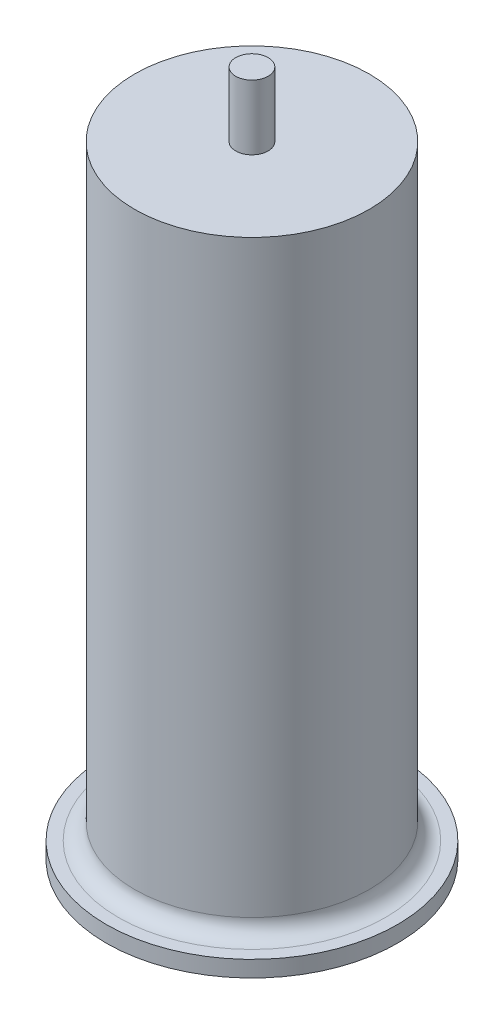
ISO-10303-21;
HEADER;
FILE_DESCRIPTION(('STEP AP214'),'2;1');
FILE_NAME('part.step','',(''),(''),'','','');
FILE_SCHEMA(('AUTOMOTIVE_DESIGN { 1 0 10303 214 1 1 1 1 }'));
ENDSEC;
DATA;
#1=APPLICATION_CONTEXT('core data for automotive mechanical design processes');
#2=APPLICATION_PROTOCOL_DEFINITION('international standard','automotive_design',2000,#1);
#3=PRODUCT_CONTEXT('',#1,'mechanical');
#4=PRODUCT('Part','Part','',(#3));
#5=PRODUCT_RELATED_PRODUCT_CATEGORY('part','',(#4));
#6=PRODUCT_DEFINITION_FORMATION('','',#4);
#7=PRODUCT_DEFINITION_CONTEXT('part definition',#1,'design');
#8=PRODUCT_DEFINITION('design','',#6,#7);
#9=PRODUCT_DEFINITION_SHAPE('','',#8);
#10=(LENGTH_UNIT() NAMED_UNIT(*) SI_UNIT(.MILLI.,.METRE.));
#11=(NAMED_UNIT(*) PLANE_ANGLE_UNIT() SI_UNIT($,.RADIAN.));
#12=(NAMED_UNIT(*) SI_UNIT($,.STERADIAN.) SOLID_ANGLE_UNIT());
#13=UNCERTAINTY_MEASURE_WITH_UNIT(LENGTH_MEASURE(1.E-05),#10,'distance_accuracy_value','');
#14=(GEOMETRIC_REPRESENTATION_CONTEXT(3) GLOBAL_UNCERTAINTY_ASSIGNED_CONTEXT((#13)) GLOBAL_UNIT_ASSIGNED_CONTEXT((#10,
#11,#12)) REPRESENTATION_CONTEXT('',''));
#15=CARTESIAN_POINT('',(0.,0.,0.));
#16=DIRECTION('',(0.,0.,1.));
#17=DIRECTION('',(1.,0.,0.));
#18=AXIS2_PLACEMENT_3D('',#15,#16,#17);
#19=CARTESIAN_POINT('',(0.,384.,0.));
#20=DIRECTION('',(0.,-1.,0.));
#21=DIRECTION('',(0.,0.,-1.));
#22=AXIS2_PLACEMENT_3D('',#19,#20,#21);
#23=CYLINDRICAL_SURFACE('',#22,72.5);
#24=CARTESIAN_POINT('',(0.,20.,0.));
#25=DIRECTION('',(0.,1.,0.));
#26=DIRECTION('',(0.,0.,1.));
#27=AXIS2_PLACEMENT_3D('',#24,#25,#26);
#28=CIRCLE('',#27,72.5);
#29=CARTESIAN_POINT('',(0.,20.,72.5));
#30=VERTEX_POINT('',#29);
#31=EDGE_CURVE('E46',#30,#30,#28,.T.);
#32=ORIENTED_EDGE('',*,*,#31,.T.);
#33=EDGE_LOOP('',(#32));
#34=FACE_BOUND('',#33,.T.);
#35=CARTESIAN_POINT('',(0.,384.,0.));
#36=DIRECTION('',(0.,1.,0.));
#37=DIRECTION('',(0.,0.,1.));
#38=AXIS2_PLACEMENT_3D('',#35,#36,#37);
#39=CIRCLE('',#38,72.5);
#40=CARTESIAN_POINT('',(0.,384.,72.5));
#41=VERTEX_POINT('',#40);
#42=EDGE_CURVE('E50',#41,#41,#39,.T.);
#43=ORIENTED_EDGE('',*,*,#42,.F.);
#44=EDGE_LOOP('',(#43));
#45=FACE_BOUND('',#44,.T.);
#46=ADVANCED_FACE('F39',(#34,#45),#23,.T.);
#47=CARTESIAN_POINT('',(0.,384.,0.));
#48=DIRECTION('',(0.,1.,0.));
#49=DIRECTION('',(0.,0.,1.));
#50=AXIS2_PLACEMENT_3D('',#47,#48,#49);
#51=PLANE('',#50);
#52=CARTESIAN_POINT('',(0.,384.,0.));
#53=DIRECTION('',(0.,1.,0.));
#54=DIRECTION('',(0.,0.,1.));
#55=AXIS2_PLACEMENT_3D('',#52,#53,#54);
#56=CIRCLE('',#55,10.);
#57=CARTESIAN_POINT('',(0.,384.,10.));
#58=VERTEX_POINT('',#57);
#59=EDGE_CURVE('E63',#58,#58,#56,.T.);
#60=ORIENTED_EDGE('',*,*,#59,.F.);
#61=EDGE_LOOP('',(#60));
#62=FACE_BOUND('',#61,.T.);
#63=ORIENTED_EDGE('',*,*,#42,.T.);
#64=EDGE_LOOP('',(#63));
#65=FACE_BOUND('',#64,.T.);
#66=ADVANCED_FACE('F77',(#62,#65),#51,.T.);
#67=CARTESIAN_POINT('',(0.,10.,0.));
#68=DIRECTION('',(0.,-1.,0.));
#69=DIRECTION('',(0.,0.,-1.));
#70=AXIS2_PLACEMENT_3D('',#67,#68,#69);
#71=CYLINDRICAL_SURFACE('',#70,90.);
#72=CARTESIAN_POINT('',(0.,10.,0.));
#73=DIRECTION('',(0.,1.,0.));
#74=DIRECTION('',(0.,0.,1.));
#75=AXIS2_PLACEMENT_3D('',#72,#73,#74);
#76=CIRCLE('',#75,90.);
#77=CARTESIAN_POINT('',(0.,10.,90.));
#78=VERTEX_POINT('',#77);
#79=EDGE_CURVE('E54',#78,#78,#76,.T.);
#80=ORIENTED_EDGE('',*,*,#79,.F.);
#81=EDGE_LOOP('',(#80));
#82=FACE_BOUND('',#81,.T.);
#83=CARTESIAN_POINT('',(0.,0.,0.));
#84=DIRECTION('',(0.,1.,0.));
#85=DIRECTION('',(0.,0.,1.));
#86=AXIS2_PLACEMENT_3D('',#83,#84,#85);
#87=CIRCLE('',#86,90.);
#88=CARTESIAN_POINT('',(0.,0.,90.));
#89=VERTEX_POINT('',#88);
#90=EDGE_CURVE('E57',#89,#89,#87,.T.);
#91=ORIENTED_EDGE('',*,*,#90,.T.);
#92=EDGE_LOOP('',(#91));
#93=FACE_BOUND('',#92,.T.);
#94=ADVANCED_FACE('F80',(#82,#93),#71,.T.);
#95=CARTESIAN_POINT('',(0.,10.,0.));
#96=DIRECTION('',(0.,1.,0.));
#97=DIRECTION('',(0.,0.,1.));
#98=AXIS2_PLACEMENT_3D('',#95,#96,#97);
#99=PLANE('',#98);
#100=CARTESIAN_POINT('',(0.,10.,0.));
#101=DIRECTION('',(0.,1.,0.));
#102=DIRECTION('',(0.,0.,1.));
#103=AXIS2_PLACEMENT_3D('',#100,#101,#102);
#104=CIRCLE('',#103,82.5);
#105=CARTESIAN_POINT('',(0.,10.,82.5));
#106=VERTEX_POINT('',#105);
#107=EDGE_CURVE('E10',#106,#106,#104,.F.);
#108=ORIENTED_EDGE('',*,*,#107,.T.);
#109=EDGE_LOOP('',(#108));
#110=FACE_BOUND('',#109,.T.);
#111=ORIENTED_EDGE('',*,*,#79,.T.);
#112=EDGE_LOOP('',(#111));
#113=FACE_BOUND('',#112,.T.);
#114=ADVANCED_FACE('F91',(#110,#113),#99,.T.);
#115=CARTESIAN_POINT('',(0.,0.,0.));
#116=DIRECTION('',(0.,1.,0.));
#117=DIRECTION('',(0.,0.,1.));
#118=AXIS2_PLACEMENT_3D('',#115,#116,#117);
#119=PLANE('',#118);
#120=ORIENTED_EDGE('',*,*,#90,.F.);
#121=EDGE_LOOP('',(#120));
#122=FACE_BOUND('',#121,.T.);
#123=ADVANCED_FACE('F90',(#122),#119,.F.);
#124=CARTESIAN_POINT('',(0.,20.,0.));
#125=DIRECTION('',(0.,1.,0.));
#126=DIRECTION('',(0.,0.,1.));
#127=AXIS2_PLACEMENT_3D('',#124,#125,#126);
#128=TOROIDAL_SURFACE('',#127,82.5,10.);
#129=ORIENTED_EDGE('',*,*,#107,.F.);
#130=EDGE_LOOP('',(#129));
#131=FACE_BOUND('',#130,.T.);
#132=ORIENTED_EDGE('',*,*,#31,.F.);
#133=EDGE_LOOP('',(#132));
#134=FACE_BOUND('',#133,.T.);
#135=ADVANCED_FACE('F41',(#131,#134),#128,.F.);
#136=CARTESIAN_POINT('',(0.,424.,0.));
#137=DIRECTION('',(0.,-1.,0.));
#138=DIRECTION('',(0.,0.,-1.));
#139=AXIS2_PLACEMENT_3D('',#136,#137,#138);
#140=CYLINDRICAL_SURFACE('',#139,10.);
#141=CARTESIAN_POINT('',(0.,424.,0.));
#142=DIRECTION('',(0.,1.,0.));
#143=DIRECTION('',(0.,0.,1.));
#144=AXIS2_PLACEMENT_3D('',#141,#142,#143);
#145=CIRCLE('',#144,10.);
#146=CARTESIAN_POINT('',(0.,424.,10.));
#147=VERTEX_POINT('',#146);
#148=EDGE_CURVE('E60',#147,#147,#145,.T.);
#149=ORIENTED_EDGE('',*,*,#148,.F.);
#150=EDGE_LOOP('',(#149));
#151=FACE_BOUND('',#150,.T.);
#152=ORIENTED_EDGE('',*,*,#59,.T.);
#153=EDGE_LOOP('',(#152));
#154=FACE_BOUND('',#153,.T.);
#155=ADVANCED_FACE('F71',(#151,#154),#140,.T.);
#156=CARTESIAN_POINT('',(0.,424.,0.));
#157=DIRECTION('',(0.,1.,0.));
#158=DIRECTION('',(0.,0.,1.));
#159=AXIS2_PLACEMENT_3D('',#156,#157,#158);
#160=PLANE('',#159);
#161=ORIENTED_EDGE('',*,*,#148,.T.);
#162=EDGE_LOOP('',(#161));
#163=FACE_BOUND('',#162,.T.);
#164=ADVANCED_FACE('F69',(#163),#160,.T.);
#165=CLOSED_SHELL('',(#46,#66,#94,#114,#123,#135,#155,#164));
#166=MANIFOLD_SOLID_BREP('B2',#165);
#167=ADVANCED_BREP_SHAPE_REPRESENTATION('',(#18,#166),#14);
#168=SHAPE_DEFINITION_REPRESENTATION(#9,#167);
ENDSEC;
END-ISO-10303-21;
